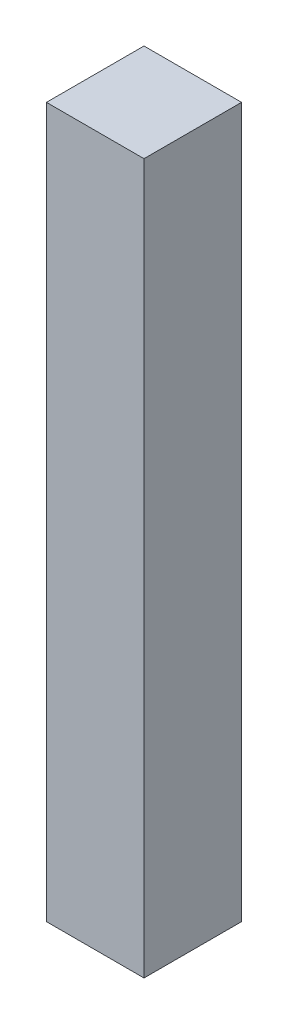
ISO-10303-21;
HEADER;
FILE_DESCRIPTION(('STEP AP214'),'2;1');
FILE_NAME('part.step','',(''),(''),'','','');
FILE_SCHEMA(('AUTOMOTIVE_DESIGN { 1 0 10303 214 1 1 1 1 }'));
ENDSEC;
DATA;
#1=APPLICATION_CONTEXT('core data for automotive mechanical design processes');
#2=APPLICATION_PROTOCOL_DEFINITION('international standard','automotive_design',2000,#1);
#3=PRODUCT_CONTEXT('',#1,'mechanical');
#4=PRODUCT('Part','Part','',(#3));
#5=PRODUCT_RELATED_PRODUCT_CATEGORY('part','',(#4));
#6=PRODUCT_DEFINITION_FORMATION('','',#4);
#7=PRODUCT_DEFINITION_CONTEXT('part definition',#1,'design');
#8=PRODUCT_DEFINITION('design','',#6,#7);
#9=PRODUCT_DEFINITION_SHAPE('','',#8);
#10=(LENGTH_UNIT() NAMED_UNIT(*) SI_UNIT(.MILLI.,.METRE.));
#11=(NAMED_UNIT(*) PLANE_ANGLE_UNIT() SI_UNIT($,.RADIAN.));
#12=(NAMED_UNIT(*) SI_UNIT($,.STERADIAN.) SOLID_ANGLE_UNIT());
#13=UNCERTAINTY_MEASURE_WITH_UNIT(LENGTH_MEASURE(1.E-05),#10,'distance_accuracy_value','');
#14=(GEOMETRIC_REPRESENTATION_CONTEXT(3) GLOBAL_UNCERTAINTY_ASSIGNED_CONTEXT((#13)) GLOBAL_UNIT_ASSIGNED_CONTEXT((#10,
#11,#12)) REPRESENTATION_CONTEXT('',''));
#15=CARTESIAN_POINT('',(0.,0.,0.));
#16=DIRECTION('',(0.,0.,1.));
#17=DIRECTION('',(1.,0.,0.));
#18=AXIS2_PLACEMENT_3D('',#15,#16,#17);
#19=CARTESIAN_POINT('',(0.,20.,0.));
#20=DIRECTION('',(1.,0.,0.));
#21=DIRECTION('',(0.,0.,-1.));
#22=AXIS2_PLACEMENT_3D('',#19,#20,#21);
#23=PLANE('',#22);
#24=DIRECTION('',(0.,0.,1.));
#25=VECTOR('',#24,1.);
#26=CARTESIAN_POINT('',(0.,0.,0.));
#27=LINE('',#26,#25);
#28=CARTESIAN_POINT('',(0.,0.,-2.75));
#29=VERTEX_POINT('',#28);
#30=CARTESIAN_POINT('',(0.,0.,0.));
#31=VERTEX_POINT('',#30);
#32=EDGE_CURVE('E101',#29,#31,#27,.T.);
#33=ORIENTED_EDGE('',*,*,#32,.T.);
#34=DIRECTION('',(0.,-1.,0.));
#35=VECTOR('',#34,1.);
#36=CARTESIAN_POINT('',(0.,20.,0.));
#37=LINE('',#36,#35);
#38=CARTESIAN_POINT('',(0.,20.,0.));
#39=VERTEX_POINT('',#38);
#40=EDGE_CURVE('E11',#39,#31,#37,.T.);
#41=ORIENTED_EDGE('',*,*,#40,.F.);
#42=DIRECTION('',(0.,0.,1.));
#43=VECTOR('',#42,1.);
#44=CARTESIAN_POINT('',(0.,20.,0.));
#45=LINE('',#44,#43);
#46=CARTESIAN_POINT('',(0.,20.,-2.75));
#47=VERTEX_POINT('',#46);
#48=EDGE_CURVE('E89',#47,#39,#45,.T.);
#49=ORIENTED_EDGE('',*,*,#48,.F.);
#50=DIRECTION('',(0.,-1.,0.));
#51=VECTOR('',#50,1.);
#52=CARTESIAN_POINT('',(0.,20.,-2.75));
#53=LINE('',#52,#51);
#54=EDGE_CURVE('E97',#47,#29,#53,.T.);
#55=ORIENTED_EDGE('',*,*,#54,.T.);
#56=EDGE_LOOP('',(#33,#41,#49,#55));
#57=FACE_BOUND('',#56,.T.);
#58=ADVANCED_FACE('F38',(#57),#23,.F.);
#59=CARTESIAN_POINT('',(0.,20.,0.));
#60=DIRECTION('',(0.,0.,-1.));
#61=DIRECTION('',(-1.,0.,0.));
#62=AXIS2_PLACEMENT_3D('',#59,#60,#61);
#63=PLANE('',#62);
#64=DIRECTION('',(1.,0.,0.));
#65=VECTOR('',#64,1.);
#66=CARTESIAN_POINT('',(0.,0.,0.));
#67=LINE('',#66,#65);
#68=CARTESIAN_POINT('',(2.75,0.,0.));
#69=VERTEX_POINT('',#68);
#70=EDGE_CURVE('E93',#31,#69,#67,.T.);
#71=ORIENTED_EDGE('',*,*,#70,.T.);
#72=DIRECTION('',(0.,-1.,0.));
#73=VECTOR('',#72,1.);
#74=CARTESIAN_POINT('',(2.75,20.,0.));
#75=LINE('',#74,#73);
#76=CARTESIAN_POINT('',(2.75,20.,0.));
#77=VERTEX_POINT('',#76);
#78=EDGE_CURVE('E46',#77,#69,#75,.T.);
#79=ORIENTED_EDGE('',*,*,#78,.F.);
#80=DIRECTION('',(1.,0.,0.));
#81=VECTOR('',#80,1.);
#82=CARTESIAN_POINT('',(0.,20.,0.));
#83=LINE('',#82,#81);
#84=EDGE_CURVE('E84',#39,#77,#83,.T.);
#85=ORIENTED_EDGE('',*,*,#84,.F.);
#86=ORIENTED_EDGE('',*,*,#40,.T.);
#87=EDGE_LOOP('',(#71,#79,#85,#86));
#88=FACE_BOUND('',#87,.T.);
#89=ADVANCED_FACE('F92',(#88),#63,.F.);
#90=CARTESIAN_POINT('',(2.75,20.,0.));
#91=DIRECTION('',(-1.,0.,0.));
#92=DIRECTION('',(0.,0.,1.));
#93=AXIS2_PLACEMENT_3D('',#90,#91,#92);
#94=PLANE('',#93);
#95=DIRECTION('',(0.,0.,-1.));
#96=VECTOR('',#95,1.);
#97=CARTESIAN_POINT('',(2.75,0.,0.));
#98=LINE('',#97,#96);
#99=CARTESIAN_POINT('',(2.75,0.,-2.75));
#100=VERTEX_POINT('',#99);
#101=EDGE_CURVE('E71',#69,#100,#98,.T.);
#102=ORIENTED_EDGE('',*,*,#101,.T.);
#103=DIRECTION('',(0.,-1.,0.));
#104=VECTOR('',#103,1.);
#105=CARTESIAN_POINT('',(2.75,20.,-2.75));
#106=LINE('',#105,#104);
#107=CARTESIAN_POINT('',(2.75,20.,-2.75));
#108=VERTEX_POINT('',#107);
#109=EDGE_CURVE('E94',#108,#100,#106,.T.);
#110=ORIENTED_EDGE('',*,*,#109,.F.);
#111=DIRECTION('',(0.,0.,-1.));
#112=VECTOR('',#111,1.);
#113=CARTESIAN_POINT('',(2.75,20.,0.));
#114=LINE('',#113,#112);
#115=EDGE_CURVE('E87',#77,#108,#114,.T.);
#116=ORIENTED_EDGE('',*,*,#115,.F.);
#117=ORIENTED_EDGE('',*,*,#78,.T.);
#118=EDGE_LOOP('',(#102,#110,#116,#117));
#119=FACE_BOUND('',#118,.T.);
#120=ADVANCED_FACE('F95',(#119),#94,.F.);
#121=CARTESIAN_POINT('',(0.,20.,-2.75));
#122=DIRECTION('',(0.,0.,1.));
#123=DIRECTION('',(1.,0.,0.));
#124=AXIS2_PLACEMENT_3D('',#121,#122,#123);
#125=PLANE('',#124);
#126=DIRECTION('',(-1.,0.,0.));
#127=VECTOR('',#126,1.);
#128=CARTESIAN_POINT('',(0.,0.,-2.75));
#129=LINE('',#128,#127);
#130=EDGE_CURVE('E77',#100,#29,#129,.T.);
#131=ORIENTED_EDGE('',*,*,#130,.T.);
#132=ORIENTED_EDGE('',*,*,#54,.F.);
#133=DIRECTION('',(-1.,0.,0.));
#134=VECTOR('',#133,1.);
#135=CARTESIAN_POINT('',(0.,20.,-2.75));
#136=LINE('',#135,#134);
#137=EDGE_CURVE('E54',#108,#47,#136,.T.);
#138=ORIENTED_EDGE('',*,*,#137,.F.);
#139=ORIENTED_EDGE('',*,*,#109,.T.);
#140=EDGE_LOOP('',(#131,#132,#138,#139));
#141=FACE_BOUND('',#140,.T.);
#142=ADVANCED_FACE('F108',(#141),#125,.F.);
#143=CARTESIAN_POINT('',(0.,20.,0.));
#144=DIRECTION('',(0.,-1.,0.));
#145=DIRECTION('',(0.,0.,-1.));
#146=AXIS2_PLACEMENT_3D('',#143,#144,#145);
#147=PLANE('',#146);
#148=ORIENTED_EDGE('',*,*,#48,.T.);
#149=ORIENTED_EDGE('',*,*,#84,.T.);
#150=ORIENTED_EDGE('',*,*,#115,.T.);
#151=ORIENTED_EDGE('',*,*,#137,.T.);
#152=EDGE_LOOP('',(#148,#149,#150,#151));
#153=FACE_BOUND('',#152,.T.);
#154=ADVANCED_FACE('F85',(#153),#147,.F.);
#155=CARTESIAN_POINT('',(0.,0.,0.));
#156=DIRECTION('',(0.,-1.,0.));
#157=DIRECTION('',(0.,0.,-1.));
#158=AXIS2_PLACEMENT_3D('',#155,#156,#157);
#159=PLANE('',#158);
#160=ORIENTED_EDGE('',*,*,#32,.F.);
#161=ORIENTED_EDGE('',*,*,#130,.F.);
#162=ORIENTED_EDGE('',*,*,#101,.F.);
#163=ORIENTED_EDGE('',*,*,#70,.F.);
#164=EDGE_LOOP('',(#160,#161,#162,#163));
#165=FACE_BOUND('',#164,.T.);
#166=ADVANCED_FACE('F111',(#165),#159,.T.);
#167=CLOSED_SHELL('',(#58,#89,#120,#142,#154,#166));
#168=MANIFOLD_SOLID_BREP('B2',#167);
#169=ADVANCED_BREP_SHAPE_REPRESENTATION('',(#18,#168),#14);
#170=SHAPE_DEFINITION_REPRESENTATION(#9,#169);
ENDSEC;
END-ISO-10303-21;
